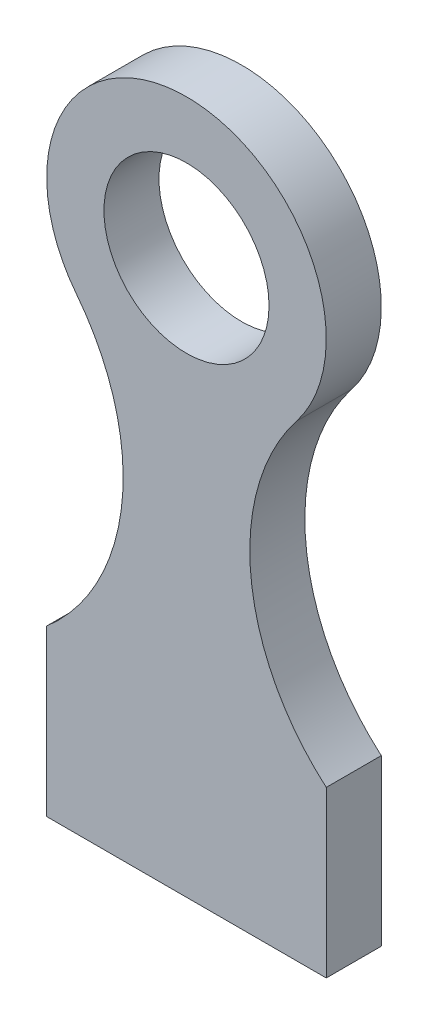
ISO-10303-21;
HEADER;
FILE_DESCRIPTION(('STEP AP214'),'2;1');
FILE_NAME('part.step','',(''),(''),'','','');
FILE_SCHEMA(('AUTOMOTIVE_DESIGN { 1 0 10303 214 1 1 1 1 }'));
ENDSEC;
DATA;
#1=APPLICATION_CONTEXT('core data for automotive mechanical design processes');
#2=APPLICATION_PROTOCOL_DEFINITION('international standard','automotive_design',2000,#1);
#3=PRODUCT_CONTEXT('',#1,'mechanical');
#4=PRODUCT('Part','Part','',(#3));
#5=PRODUCT_RELATED_PRODUCT_CATEGORY('part','',(#4));
#6=PRODUCT_DEFINITION_FORMATION('','',#4);
#7=PRODUCT_DEFINITION_CONTEXT('part definition',#1,'design');
#8=PRODUCT_DEFINITION('design','',#6,#7);
#9=PRODUCT_DEFINITION_SHAPE('','',#8);
#10=(LENGTH_UNIT() NAMED_UNIT(*) SI_UNIT(.MILLI.,.METRE.));
#11=(NAMED_UNIT(*) PLANE_ANGLE_UNIT() SI_UNIT($,.RADIAN.));
#12=(NAMED_UNIT(*) SI_UNIT($,.STERADIAN.) SOLID_ANGLE_UNIT());
#13=UNCERTAINTY_MEASURE_WITH_UNIT(LENGTH_MEASURE(1.E-05),#10,'distance_accuracy_value','');
#14=(GEOMETRIC_REPRESENTATION_CONTEXT(3) GLOBAL_UNCERTAINTY_ASSIGNED_CONTEXT((#13)) GLOBAL_UNIT_ASSIGNED_CONTEXT((#10,
#11,#12)) REPRESENTATION_CONTEXT('',''));
#15=CARTESIAN_POINT('',(0.,0.,0.));
#16=DIRECTION('',(0.,0.,1.));
#17=DIRECTION('',(1.,0.,0.));
#18=AXIS2_PLACEMENT_3D('',#15,#16,#17);
#19=CARTESIAN_POINT('',(-1.69884101404409,-0.00263762069487201,0.5));
#20=DIRECTION('',(0.,0.,1.));
#21=DIRECTION('',(1.,0.,0.));
#22=AXIS2_PLACEMENT_3D('',#19,#20,#21);
#23=PLANE('',#22);
#24=DIRECTION('',(0.,1.,0.));
#25=VECTOR('',#24,1.);
#26=CARTESIAN_POINT('',(2.14666666666666,-1.51777777777778,0.5));
#27=LINE('',#26,#25);
#28=CARTESIAN_POINT('',(2.14666666666666,-3.01777777777778,0.5));
#29=VERTEX_POINT('',#28);
#30=CARTESIAN_POINT('',(2.14666666666666,-1.51777777777778,0.5));
#31=VERTEX_POINT('',#30);
#32=EDGE_CURVE('E129',#29,#31,#27,.T.);
#33=ORIENTED_EDGE('',*,*,#32,.T.);
#34=CARTESIAN_POINT('',(3.45217434737742,-0.00263762069487115,0.5));
#35=DIRECTION('',(0.,0.,-1.));
#36=DIRECTION('',(-1.,0.,0.));
#37=AXIS2_PLACEMENT_3D('',#34,#35,#36);
#38=CIRCLE('',#37,2.);
#39=CARTESIAN_POINT('',(1.87694029189683,1.22969255845931,0.5));
#40=VERTEX_POINT('',#39);
#41=EDGE_CURVE('E87',#31,#40,#38,.T.);
#42=ORIENTED_EDGE('',*,*,#41,.T.);
#43=CARTESIAN_POINT('',(0.876666666666663,2.01222222222222,0.5));
#44=DIRECTION('',(0.,0.,1.));
#45=DIRECTION('',(1.,0.,0.));
#46=AXIS2_PLACEMENT_3D('',#43,#44,#45);
#47=CIRCLE('',#46,1.27);
#48=CARTESIAN_POINT('',(-0.123606958563509,1.22969255845931,0.5));
#49=VERTEX_POINT('',#48);
#50=EDGE_CURVE('E100',#40,#49,#47,.T.);
#51=ORIENTED_EDGE('',*,*,#50,.T.);
#52=CARTESIAN_POINT('',(-1.69884101404409,-0.00263762069487201,0.5));
#53=DIRECTION('',(0.,0.,-1.));
#54=DIRECTION('',(1.,0.,0.));
#55=AXIS2_PLACEMENT_3D('',#52,#53,#54);
#56=CIRCLE('',#55,2.);
#57=CARTESIAN_POINT('',(-0.393333333333336,-1.51777777777778,0.5));
#58=VERTEX_POINT('',#57);
#59=EDGE_CURVE('E94',#49,#58,#56,.T.);
#60=ORIENTED_EDGE('',*,*,#59,.T.);
#61=DIRECTION('',(0.,-1.,0.));
#62=VECTOR('',#61,1.);
#63=CARTESIAN_POINT('',(-0.393333333333336,-1.51777777777778,0.5));
#64=LINE('',#63,#62);
#65=CARTESIAN_POINT('',(-0.393333333333336,-3.01777777777778,0.5));
#66=VERTEX_POINT('',#65);
#67=EDGE_CURVE('E98',#58,#66,#64,.T.);
#68=ORIENTED_EDGE('',*,*,#67,.T.);
#69=DIRECTION('',(1.,0.,0.));
#70=VECTOR('',#69,1.);
#71=CARTESIAN_POINT('',(-0.393333333333336,-3.01777777777778,0.5));
#72=LINE('',#71,#70);
#73=EDGE_CURVE('E50',#66,#29,#72,.T.);
#74=ORIENTED_EDGE('',*,*,#73,.T.);
#75=EDGE_LOOP('',(#33,#42,#51,#60,#68,#74));
#76=FACE_BOUND('',#75,.T.);
#77=CARTESIAN_POINT('',(0.876666666666663,2.01222222222222,0.5));
#78=DIRECTION('',(0.,0.,1.));
#79=DIRECTION('',(1.,0.,0.));
#80=AXIS2_PLACEMENT_3D('',#77,#78,#79);
#81=CIRCLE('',#80,0.75);
#82=CARTESIAN_POINT('',(1.62666666666666,2.01222222222222,0.5));
#83=VERTEX_POINT('',#82);
#84=EDGE_CURVE('E122',#83,#83,#81,.T.);
#85=ORIENTED_EDGE('',*,*,#84,.F.);
#86=EDGE_LOOP('',(#85));
#87=FACE_BOUND('',#86,.T.);
#88=ADVANCED_FACE('F33',(#76,#87),#23,.T.);
#89=CARTESIAN_POINT('',(-1.69884101404409,-0.00263762069487201,0.));
#90=DIRECTION('',(0.,0.,1.));
#91=DIRECTION('',(1.,0.,0.));
#92=AXIS2_PLACEMENT_3D('',#89,#90,#91);
#93=PLANE('',#92);
#94=DIRECTION('',(0.,1.,0.));
#95=VECTOR('',#94,1.);
#96=CARTESIAN_POINT('',(2.14666666666666,-1.51777777777778,0.));
#97=LINE('',#96,#95);
#98=CARTESIAN_POINT('',(2.14666666666666,-3.01777777777778,0.));
#99=VERTEX_POINT('',#98);
#100=CARTESIAN_POINT('',(2.14666666666666,-1.51777777777778,0.));
#101=VERTEX_POINT('',#100);
#102=EDGE_CURVE('E118',#99,#101,#97,.T.);
#103=ORIENTED_EDGE('',*,*,#102,.F.);
#104=DIRECTION('',(1.,0.,0.));
#105=VECTOR('',#104,1.);
#106=CARTESIAN_POINT('',(-0.393333333333336,-3.01777777777778,0.));
#107=LINE('',#106,#105);
#108=CARTESIAN_POINT('',(-0.393333333333336,-3.01777777777778,0.));
#109=VERTEX_POINT('',#108);
#110=EDGE_CURVE('E79',#109,#99,#107,.T.);
#111=ORIENTED_EDGE('',*,*,#110,.F.);
#112=DIRECTION('',(0.,-1.,0.));
#113=VECTOR('',#112,1.);
#114=CARTESIAN_POINT('',(-0.393333333333336,-1.51777777777778,0.));
#115=LINE('',#114,#113);
#116=CARTESIAN_POINT('',(-0.393333333333336,-1.51777777777778,0.));
#117=VERTEX_POINT('',#116);
#118=EDGE_CURVE('E73',#117,#109,#115,.T.);
#119=ORIENTED_EDGE('',*,*,#118,.F.);
#120=CARTESIAN_POINT('',(-1.69884101404409,-0.00263762069487201,0.));
#121=DIRECTION('',(0.,0.,-1.));
#122=DIRECTION('',(1.,0.,0.));
#123=AXIS2_PLACEMENT_3D('',#120,#121,#122);
#124=CIRCLE('',#123,2.);
#125=CARTESIAN_POINT('',(-0.123606958563509,1.22969255845931,0.));
#126=VERTEX_POINT('',#125);
#127=EDGE_CURVE('E108',#126,#117,#124,.T.);
#128=ORIENTED_EDGE('',*,*,#127,.F.);
#129=CARTESIAN_POINT('',(0.876666666666663,2.01222222222222,0.));
#130=DIRECTION('',(0.,0.,1.));
#131=DIRECTION('',(1.,0.,0.));
#132=AXIS2_PLACEMENT_3D('',#129,#130,#131);
#133=CIRCLE('',#132,1.27);
#134=CARTESIAN_POINT('',(1.87694029189683,1.22969255845931,0.));
#135=VERTEX_POINT('',#134);
#136=EDGE_CURVE('E124',#135,#126,#133,.T.);
#137=ORIENTED_EDGE('',*,*,#136,.F.);
#138=CARTESIAN_POINT('',(3.45217434737742,-0.00263762069487115,0.));
#139=DIRECTION('',(0.,0.,-1.));
#140=DIRECTION('',(-1.,0.,0.));
#141=AXIS2_PLACEMENT_3D('',#138,#139,#140);
#142=CIRCLE('',#141,2.);
#143=EDGE_CURVE('E121',#101,#135,#142,.T.);
#144=ORIENTED_EDGE('',*,*,#143,.F.);
#145=EDGE_LOOP('',(#103,#111,#119,#128,#137,#144));
#146=FACE_BOUND('',#145,.T.);
#147=CARTESIAN_POINT('',(0.876666666666663,2.01222222222222,0.));
#148=DIRECTION('',(0.,0.,1.));
#149=DIRECTION('',(1.,0.,0.));
#150=AXIS2_PLACEMENT_3D('',#147,#148,#149);
#151=CIRCLE('',#150,0.75);
#152=CARTESIAN_POINT('',(1.62666666666666,2.01222222222222,0.));
#153=VERTEX_POINT('',#152);
#154=EDGE_CURVE('E222',#153,#153,#151,.T.);
#155=ORIENTED_EDGE('',*,*,#154,.T.);
#156=EDGE_LOOP('',(#155));
#157=FACE_BOUND('',#156,.T.);
#158=ADVANCED_FACE('F138',(#146,#157),#93,.F.);
#159=CARTESIAN_POINT('',(2.14666666666666,-1.51777777777778,0.5));
#160=DIRECTION('',(-1.,0.,0.));
#161=DIRECTION('',(0.,-1.,0.));
#162=AXIS2_PLACEMENT_3D('',#159,#160,#161);
#163=PLANE('',#162);
#164=ORIENTED_EDGE('',*,*,#102,.T.);
#165=DIRECTION('',(0.,0.,-1.));
#166=VECTOR('',#165,1.);
#167=CARTESIAN_POINT('',(2.14666666666666,-1.51777777777778,0.5));
#168=LINE('',#167,#166);
#169=EDGE_CURVE('E11',#31,#101,#168,.T.);
#170=ORIENTED_EDGE('',*,*,#169,.F.);
#171=ORIENTED_EDGE('',*,*,#32,.F.);
#172=DIRECTION('',(0.,0.,-1.));
#173=VECTOR('',#172,1.);
#174=CARTESIAN_POINT('',(2.14666666666666,-3.01777777777778,0.5));
#175=LINE('',#174,#173);
#176=EDGE_CURVE('E114',#29,#99,#175,.T.);
#177=ORIENTED_EDGE('',*,*,#176,.T.);
#178=EDGE_LOOP('',(#164,#170,#171,#177));
#179=FACE_BOUND('',#178,.T.);
#180=ADVANCED_FACE('F35',(#179),#163,.F.);
#181=CARTESIAN_POINT('',(3.45217434737742,-0.00263762069487115,0.5));
#182=DIRECTION('',(0.,0.,-1.));
#183=DIRECTION('',(-1.,0.,0.));
#184=AXIS2_PLACEMENT_3D('',#181,#182,#183);
#185=CYLINDRICAL_SURFACE('',#184,2.);
#186=ORIENTED_EDGE('',*,*,#143,.T.);
#187=DIRECTION('',(0.,0.,-1.));
#188=VECTOR('',#187,1.);
#189=CARTESIAN_POINT('',(1.87694029189683,1.22969255845931,0.5));
#190=LINE('',#189,#188);
#191=EDGE_CURVE('E42',#40,#135,#190,.T.);
#192=ORIENTED_EDGE('',*,*,#191,.F.);
#193=ORIENTED_EDGE('',*,*,#41,.F.);
#194=ORIENTED_EDGE('',*,*,#169,.T.);
#195=EDGE_LOOP('',(#186,#192,#193,#194));
#196=FACE_BOUND('',#195,.T.);
#197=ADVANCED_FACE('F163',(#196),#185,.F.);
#198=CARTESIAN_POINT('',(0.876666666666663,2.01222222222222,0.5));
#199=DIRECTION('',(0.,0.,-1.));
#200=DIRECTION('',(-1.,0.,0.));
#201=AXIS2_PLACEMENT_3D('',#198,#199,#200);
#202=CYLINDRICAL_SURFACE('',#201,1.27);
#203=ORIENTED_EDGE('',*,*,#136,.T.);
#204=DIRECTION('',(0.,0.,-1.));
#205=VECTOR('',#204,1.);
#206=CARTESIAN_POINT('',(-0.123606958563509,1.22969255845931,0.5));
#207=LINE('',#206,#205);
#208=EDGE_CURVE('E109',#49,#126,#207,.T.);
#209=ORIENTED_EDGE('',*,*,#208,.F.);
#210=ORIENTED_EDGE('',*,*,#50,.F.);
#211=ORIENTED_EDGE('',*,*,#191,.T.);
#212=EDGE_LOOP('',(#203,#209,#210,#211));
#213=FACE_BOUND('',#212,.T.);
#214=ADVANCED_FACE('F135',(#213),#202,.T.);
#215=CARTESIAN_POINT('',(-1.69884101404409,-0.00263762069487201,0.5));
#216=DIRECTION('',(0.,0.,-1.));
#217=DIRECTION('',(-1.,0.,0.));
#218=AXIS2_PLACEMENT_3D('',#215,#216,#217);
#219=CYLINDRICAL_SURFACE('',#218,2.);
#220=ORIENTED_EDGE('',*,*,#127,.T.);
#221=DIRECTION('',(0.,0.,-1.));
#222=VECTOR('',#221,1.);
#223=CARTESIAN_POINT('',(-0.393333333333336,-1.51777777777778,0.5));
#224=LINE('',#223,#222);
#225=EDGE_CURVE('E105',#58,#117,#224,.T.);
#226=ORIENTED_EDGE('',*,*,#225,.F.);
#227=ORIENTED_EDGE('',*,*,#59,.F.);
#228=ORIENTED_EDGE('',*,*,#208,.T.);
#229=EDGE_LOOP('',(#220,#226,#227,#228));
#230=FACE_BOUND('',#229,.T.);
#231=ADVANCED_FACE('F106',(#230),#219,.F.);
#232=CARTESIAN_POINT('',(-0.393333333333336,-1.51777777777778,0.5));
#233=DIRECTION('',(1.,0.,0.));
#234=DIRECTION('',(0.,1.,0.));
#235=AXIS2_PLACEMENT_3D('',#232,#233,#234);
#236=PLANE('',#235);
#237=ORIENTED_EDGE('',*,*,#118,.T.);
#238=DIRECTION('',(0.,0.,-1.));
#239=VECTOR('',#238,1.);
#240=CARTESIAN_POINT('',(-0.393333333333336,-3.01777777777778,0.5));
#241=LINE('',#240,#239);
#242=EDGE_CURVE('E110',#66,#109,#241,.T.);
#243=ORIENTED_EDGE('',*,*,#242,.F.);
#244=ORIENTED_EDGE('',*,*,#67,.F.);
#245=ORIENTED_EDGE('',*,*,#225,.T.);
#246=EDGE_LOOP('',(#237,#243,#244,#245));
#247=FACE_BOUND('',#246,.T.);
#248=ADVANCED_FACE('F112',(#247),#236,.F.);
#249=CARTESIAN_POINT('',(-0.393333333333336,-3.01777777777778,0.5));
#250=DIRECTION('',(0.,1.,0.));
#251=DIRECTION('',(0.,0.,1.));
#252=AXIS2_PLACEMENT_3D('',#249,#250,#251);
#253=PLANE('',#252);
#254=ORIENTED_EDGE('',*,*,#110,.T.);
#255=ORIENTED_EDGE('',*,*,#176,.F.);
#256=ORIENTED_EDGE('',*,*,#73,.F.);
#257=ORIENTED_EDGE('',*,*,#242,.T.);
#258=EDGE_LOOP('',(#254,#255,#256,#257));
#259=FACE_BOUND('',#258,.T.);
#260=ADVANCED_FACE('F143',(#259),#253,.F.);
#261=CARTESIAN_POINT('',(0.876666666666663,2.01222222222222,0.5));
#262=DIRECTION('',(0.,0.,-1.));
#263=DIRECTION('',(-1.,0.,0.));
#264=AXIS2_PLACEMENT_3D('',#261,#262,#263);
#265=CYLINDRICAL_SURFACE('',#264,0.75);
#266=ORIENTED_EDGE('',*,*,#84,.T.);
#267=EDGE_LOOP('',(#266));
#268=FACE_BOUND('',#267,.T.);
#269=ORIENTED_EDGE('',*,*,#154,.F.);
#270=EDGE_LOOP('',(#269));
#271=FACE_BOUND('',#270,.T.);
#272=ADVANCED_FACE('F145',(#268,#271),#265,.F.);
#273=CLOSED_SHELL('',(#88,#158,#180,#197,#214,#231,#248,#260,#272));
#274=MANIFOLD_SOLID_BREP('B2',#273);
#275=ADVANCED_BREP_SHAPE_REPRESENTATION('',(#18,#274),#14);
#276=SHAPE_DEFINITION_REPRESENTATION(#9,#275);
ENDSEC;
END-ISO-10303-21;
